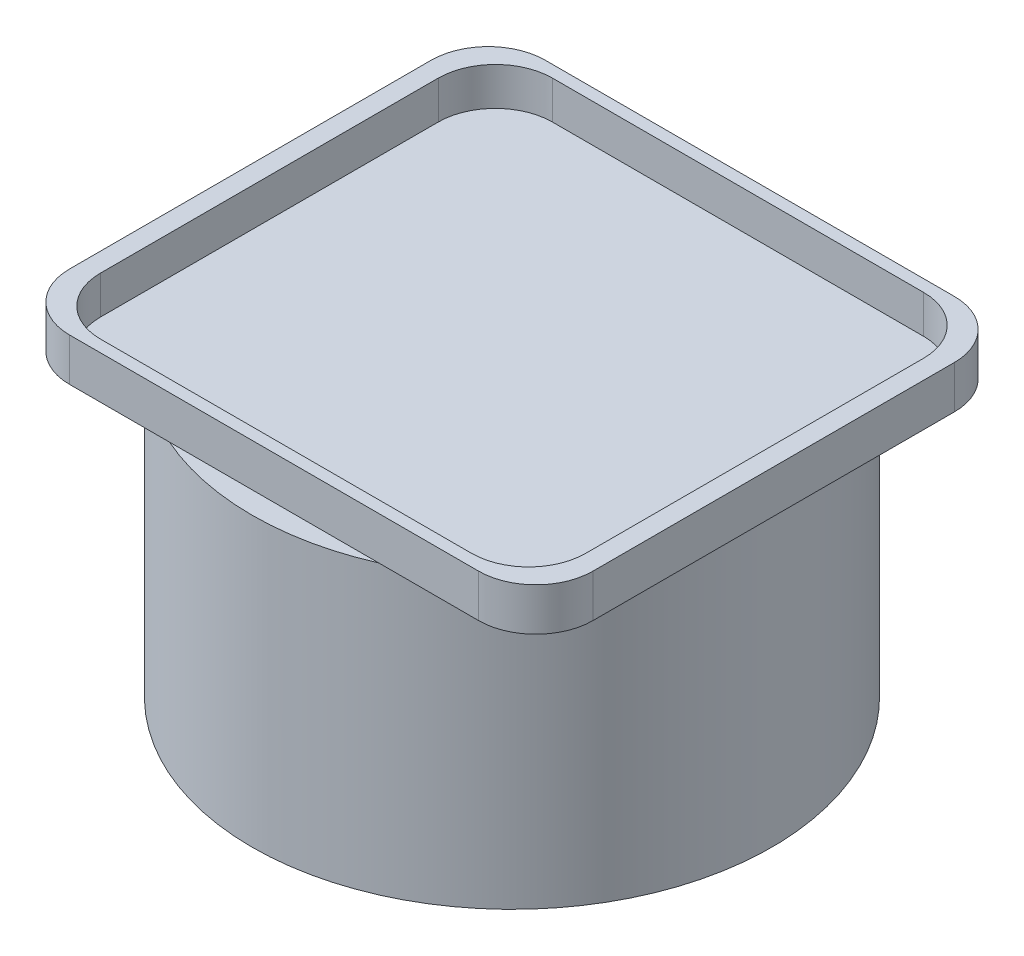
ISO-10303-21;
HEADER;
FILE_DESCRIPTION(('STEP AP214'),'2;1');
FILE_NAME('part.step','',(''),(''),'','','');
FILE_SCHEMA(('AUTOMOTIVE_DESIGN { 1 0 10303 214 1 1 1 1 }'));
ENDSEC;
DATA;
#1=APPLICATION_CONTEXT('core data for automotive mechanical design processes');
#2=APPLICATION_PROTOCOL_DEFINITION('international standard','automotive_design',2000,#1);
#3=PRODUCT_CONTEXT('',#1,'mechanical');
#4=PRODUCT('Part','Part','',(#3));
#5=PRODUCT_RELATED_PRODUCT_CATEGORY('part','',(#4));
#6=PRODUCT_DEFINITION_FORMATION('','',#4);
#7=PRODUCT_DEFINITION_CONTEXT('part definition',#1,'design');
#8=PRODUCT_DEFINITION('design','',#6,#7);
#9=PRODUCT_DEFINITION_SHAPE('','',#8);
#10=(LENGTH_UNIT() NAMED_UNIT(*) SI_UNIT(.MILLI.,.METRE.));
#11=(NAMED_UNIT(*) PLANE_ANGLE_UNIT() SI_UNIT($,.RADIAN.));
#12=(NAMED_UNIT(*) SI_UNIT($,.STERADIAN.) SOLID_ANGLE_UNIT());
#13=UNCERTAINTY_MEASURE_WITH_UNIT(LENGTH_MEASURE(1.E-05),#10,'distance_accuracy_value','');
#14=(GEOMETRIC_REPRESENTATION_CONTEXT(3) GLOBAL_UNCERTAINTY_ASSIGNED_CONTEXT((#13)) GLOBAL_UNIT_ASSIGNED_CONTEXT((#10,
#11,#12)) REPRESENTATION_CONTEXT('',''));
#15=CARTESIAN_POINT('',(0.,0.,0.));
#16=DIRECTION('',(0.,0.,1.));
#17=DIRECTION('',(1.,0.,0.));
#18=AXIS2_PLACEMENT_3D('',#15,#16,#17);
#19=CARTESIAN_POINT('',(-10.922,-0.254,-9.652));
#20=DIRECTION('',(0.,-1.,0.));
#21=DIRECTION('',(0.,0.,-1.));
#22=AXIS2_PLACEMENT_3D('',#19,#20,#21);
#23=PLANE('',#22);
#24=CARTESIAN_POINT('',(0.,-0.254,0.));
#25=DIRECTION('',(0.,-1.,0.));
#26=DIRECTION('',(0.,0.,-1.));
#27=AXIS2_PLACEMENT_3D('',#24,#25,#26);
#28=CIRCLE('',#27,13.87475);
#29=CARTESIAN_POINT('',(5.58736857227979,-0.254,-12.7));
#30=VERTEX_POINT('',#29);
#31=CARTESIAN_POINT('',(5.5873685722798,-0.254,12.7));
#32=VERTEX_POINT('',#31);
#33=EDGE_CURVE('E44',#30,#32,#28,.T.);
#34=ORIENTED_EDGE('',*,*,#33,.F.);
#35=DIRECTION('',(1.,0.,0.));
#36=VECTOR('',#35,1.);
#37=CARTESIAN_POINT('',(-10.922,-0.254,-12.7));
#38=LINE('',#37,#36);
#39=CARTESIAN_POINT('',(10.922,-0.254,-12.7));
#40=VERTEX_POINT('',#39);
#41=EDGE_CURVE('E171',#30,#40,#38,.T.);
#42=ORIENTED_EDGE('',*,*,#41,.T.);
#43=CARTESIAN_POINT('',(10.922,-0.254,-9.652));
#44=DIRECTION('',(0.,-1.,0.));
#45=DIRECTION('',(0.,0.,-1.));
#46=AXIS2_PLACEMENT_3D('',#43,#44,#45);
#47=CIRCLE('',#46,3.048);
#48=CARTESIAN_POINT('',(13.97,-0.254,-9.652));
#49=VERTEX_POINT('',#48);
#50=EDGE_CURVE('E168',#40,#49,#47,.T.);
#51=ORIENTED_EDGE('',*,*,#50,.T.);
#52=DIRECTION('',(0.,0.,1.));
#53=VECTOR('',#52,1.);
#54=CARTESIAN_POINT('',(13.97,-0.254,-9.652));
#55=LINE('',#54,#53);
#56=CARTESIAN_POINT('',(13.97,-0.254,9.65199999999998));
#57=VERTEX_POINT('',#56);
#58=EDGE_CURVE('E193',#49,#57,#55,.T.);
#59=ORIENTED_EDGE('',*,*,#58,.T.);
#60=CARTESIAN_POINT('',(10.922,-0.254,9.652));
#61=DIRECTION('',(0.,-1.,0.));
#62=DIRECTION('',(0.,0.,-1.));
#63=AXIS2_PLACEMENT_3D('',#60,#61,#62);
#64=CIRCLE('',#63,3.048);
#65=CARTESIAN_POINT('',(10.922,-0.254,12.7));
#66=VERTEX_POINT('',#65);
#67=EDGE_CURVE('E196',#57,#66,#64,.T.);
#68=ORIENTED_EDGE('',*,*,#67,.T.);
#69=DIRECTION('',(-1.,0.,0.));
#70=VECTOR('',#69,1.);
#71=CARTESIAN_POINT('',(10.922,-0.254,12.7));
#72=LINE('',#71,#70);
#73=EDGE_CURVE('E200',#66,#32,#72,.T.);
#74=ORIENTED_EDGE('',*,*,#73,.T.);
#75=EDGE_LOOP('',(#34,#42,#51,#59,#68,#74));
#76=FACE_BOUND('',#75,.T.);
#77=ADVANCED_FACE('F34',(#76),#23,.T.);
#78=CARTESIAN_POINT('',(-10.922,2.032,-9.652));
#79=DIRECTION('',(0.,-1.,0.));
#80=DIRECTION('',(0.,0.,-1.));
#81=AXIS2_PLACEMENT_3D('',#78,#79,#80);
#82=PLANE('',#81);
#83=CARTESIAN_POINT('',(-10.922,2.032,-9.652));
#84=DIRECTION('',(0.,1.,0.));
#85=DIRECTION('',(0.,0.,-1.));
#86=AXIS2_PLACEMENT_3D('',#83,#84,#85);
#87=CIRCLE('',#86,3.048);
#88=CARTESIAN_POINT('',(-10.922,2.032,-12.7));
#89=VERTEX_POINT('',#88);
#90=CARTESIAN_POINT('',(-13.97,2.032,-9.65199999999998));
#91=VERTEX_POINT('',#90);
#92=EDGE_CURVE('E267',#89,#91,#87,.T.);
#93=ORIENTED_EDGE('',*,*,#92,.T.);
#94=DIRECTION('',(0.,0.,1.));
#95=VECTOR('',#94,1.);
#96=CARTESIAN_POINT('',(-13.97,2.032,9.65199999999998));
#97=LINE('',#96,#95);
#98=CARTESIAN_POINT('',(-13.97,2.032,9.65199999999998));
#99=VERTEX_POINT('',#98);
#100=EDGE_CURVE('E270',#91,#99,#97,.T.);
#101=ORIENTED_EDGE('',*,*,#100,.T.);
#102=CARTESIAN_POINT('',(-10.922,2.032,9.652));
#103=DIRECTION('',(0.,1.,0.));
#104=DIRECTION('',(0.,0.,-1.));
#105=AXIS2_PLACEMENT_3D('',#102,#103,#104);
#106=CIRCLE('',#105,3.048);
#107=CARTESIAN_POINT('',(-10.922,2.032,12.7));
#108=VERTEX_POINT('',#107);
#109=EDGE_CURVE('E272',#99,#108,#106,.T.);
#110=ORIENTED_EDGE('',*,*,#109,.T.);
#111=DIRECTION('',(1.,0.,0.));
#112=VECTOR('',#111,1.);
#113=CARTESIAN_POINT('',(-10.922,2.032,12.7));
#114=LINE('',#113,#112);
#115=CARTESIAN_POINT('',(10.922,2.032,12.7));
#116=VERTEX_POINT('',#115);
#117=EDGE_CURVE('E274',#108,#116,#114,.T.);
#118=ORIENTED_EDGE('',*,*,#117,.T.);
#119=CARTESIAN_POINT('',(10.922,2.032,9.652));
#120=DIRECTION('',(0.,1.,0.));
#121=DIRECTION('',(0.,0.,-1.));
#122=AXIS2_PLACEMENT_3D('',#119,#120,#121);
#123=CIRCLE('',#122,3.048);
#124=CARTESIAN_POINT('',(13.97,2.032,9.65199999999998));
#125=VERTEX_POINT('',#124);
#126=EDGE_CURVE('E276',#116,#125,#123,.T.);
#127=ORIENTED_EDGE('',*,*,#126,.T.);
#128=DIRECTION('',(0.,0.,-1.));
#129=VECTOR('',#128,1.);
#130=CARTESIAN_POINT('',(13.97,2.032,9.65199999999998));
#131=LINE('',#130,#129);
#132=CARTESIAN_POINT('',(13.97,2.032,-9.65199999999998));
#133=VERTEX_POINT('',#132);
#134=EDGE_CURVE('E278',#125,#133,#131,.T.);
#135=ORIENTED_EDGE('',*,*,#134,.T.);
#136=CARTESIAN_POINT('',(10.922,2.032,-9.652));
#137=DIRECTION('',(0.,1.,0.));
#138=DIRECTION('',(0.,0.,-1.));
#139=AXIS2_PLACEMENT_3D('',#136,#137,#138);
#140=CIRCLE('',#139,3.048);
#141=CARTESIAN_POINT('',(10.922,2.032,-12.7));
#142=VERTEX_POINT('',#141);
#143=EDGE_CURVE('E280',#133,#142,#140,.T.);
#144=ORIENTED_EDGE('',*,*,#143,.T.);
#145=DIRECTION('',(-1.,0.,0.));
#146=VECTOR('',#145,1.);
#147=CARTESIAN_POINT('',(-10.922,2.032,-12.7));
#148=LINE('',#147,#146);
#149=EDGE_CURVE('E282',#142,#89,#148,.T.);
#150=ORIENTED_EDGE('',*,*,#149,.T.);
#151=EDGE_LOOP('',(#93,#101,#110,#118,#127,#135,#144,#150));
#152=FACE_BOUND('',#151,.T.);
#153=CARTESIAN_POINT('',(-9.906,2.032,9.017));
#154=DIRECTION('',(0.,1.,0.));
#155=DIRECTION('',(0.,0.,1.));
#156=AXIS2_PLACEMENT_3D('',#153,#154,#155);
#157=CIRCLE('',#156,3.048);
#158=CARTESIAN_POINT('',(-12.954,2.032,9.01699999999998));
#159=VERTEX_POINT('',#158);
#160=CARTESIAN_POINT('',(-9.90599999999998,2.032,12.065));
#161=VERTEX_POINT('',#160);
#162=EDGE_CURVE('E208',#159,#161,#157,.T.);
#163=ORIENTED_EDGE('',*,*,#162,.F.);
#164=DIRECTION('',(0.,0.,1.));
#165=VECTOR('',#164,1.);
#166=CARTESIAN_POINT('',(-12.954,2.032,9.01699999999998));
#167=LINE('',#166,#165);
#168=CARTESIAN_POINT('',(-12.954,2.032,-9.01699999999998));
#169=VERTEX_POINT('',#168);
#170=EDGE_CURVE('E224',#169,#159,#167,.T.);
#171=ORIENTED_EDGE('',*,*,#170,.F.);
#172=CARTESIAN_POINT('',(-9.906,2.032,-9.017));
#173=DIRECTION('',(0.,1.,0.));
#174=DIRECTION('',(0.,0.,1.));
#175=AXIS2_PLACEMENT_3D('',#172,#173,#174);
#176=CIRCLE('',#175,3.048);
#177=CARTESIAN_POINT('',(-9.90599999999998,2.032,-12.065));
#178=VERTEX_POINT('',#177);
#179=EDGE_CURVE('E221',#178,#169,#176,.T.);
#180=ORIENTED_EDGE('',*,*,#179,.F.);
#181=DIRECTION('',(-1.,0.,0.));
#182=VECTOR('',#181,1.);
#183=CARTESIAN_POINT('',(-9.90599999999998,2.032,-12.065));
#184=LINE('',#183,#182);
#185=CARTESIAN_POINT('',(9.90599999999998,2.032,-12.065));
#186=VERTEX_POINT('',#185);
#187=EDGE_CURVE('E219',#186,#178,#184,.T.);
#188=ORIENTED_EDGE('',*,*,#187,.F.);
#189=CARTESIAN_POINT('',(9.906,2.032,-9.017));
#190=DIRECTION('',(0.,1.,0.));
#191=DIRECTION('',(0.,0.,1.));
#192=AXIS2_PLACEMENT_3D('',#189,#190,#191);
#193=CIRCLE('',#192,3.048);
#194=CARTESIAN_POINT('',(12.954,2.032,-9.01699999999998));
#195=VERTEX_POINT('',#194);
#196=EDGE_CURVE('E217',#195,#186,#193,.T.);
#197=ORIENTED_EDGE('',*,*,#196,.F.);
#198=DIRECTION('',(0.,0.,-1.));
#199=VECTOR('',#198,1.);
#200=CARTESIAN_POINT('',(12.954,2.032,9.01699999999998));
#201=LINE('',#200,#199);
#202=CARTESIAN_POINT('',(12.954,2.032,9.01699999999998));
#203=VERTEX_POINT('',#202);
#204=EDGE_CURVE('E215',#203,#195,#201,.T.);
#205=ORIENTED_EDGE('',*,*,#204,.F.);
#206=CARTESIAN_POINT('',(9.906,2.032,9.017));
#207=DIRECTION('',(0.,1.,0.));
#208=DIRECTION('',(0.,0.,1.));
#209=AXIS2_PLACEMENT_3D('',#206,#207,#208);
#210=CIRCLE('',#209,3.048);
#211=CARTESIAN_POINT('',(9.90599999999998,2.032,12.065));
#212=VERTEX_POINT('',#211);
#213=EDGE_CURVE('E213',#212,#203,#210,.T.);
#214=ORIENTED_EDGE('',*,*,#213,.F.);
#215=DIRECTION('',(1.,0.,0.));
#216=VECTOR('',#215,1.);
#217=CARTESIAN_POINT('',(-9.90599999999998,2.032,12.065));
#218=LINE('',#217,#216);
#219=EDGE_CURVE('E210',#161,#212,#218,.T.);
#220=ORIENTED_EDGE('',*,*,#219,.F.);
#221=EDGE_LOOP('',(#163,#171,#180,#188,#197,#205,#214,#220));
#222=FACE_BOUND('',#221,.T.);
#223=ADVANCED_FACE('F311',(#152,#222),#82,.F.);
#224=CARTESIAN_POINT('',(-10.922,2.032,-9.652));
#225=DIRECTION('',(0.,-1.,0.));
#226=DIRECTION('',(0.,0.,-1.));
#227=AXIS2_PLACEMENT_3D('',#224,#225,#226);
#228=CYLINDRICAL_SURFACE('',#227,3.048);
#229=DIRECTION('',(0.,-1.,0.));
#230=VECTOR('',#229,1.);
#231=CARTESIAN_POINT('',(-10.922,2.032,-12.7));
#232=LINE('',#231,#230);
#233=CARTESIAN_POINT('',(-10.922,-0.254,-12.7));
#234=VERTEX_POINT('',#233);
#235=EDGE_CURVE('E284',#89,#234,#232,.T.);
#236=ORIENTED_EDGE('',*,*,#235,.T.);
#237=CARTESIAN_POINT('',(-10.922,-0.254,-9.652));
#238=DIRECTION('',(0.,-1.,0.));
#239=DIRECTION('',(0.,0.,-1.));
#240=AXIS2_PLACEMENT_3D('',#237,#238,#239);
#241=CIRCLE('',#240,3.048);
#242=CARTESIAN_POINT('',(-13.97,-0.254,-9.65199999999998));
#243=VERTEX_POINT('',#242);
#244=EDGE_CURVE('E165',#243,#234,#241,.T.);
#245=ORIENTED_EDGE('',*,*,#244,.F.);
#246=DIRECTION('',(0.,-1.,0.));
#247=VECTOR('',#246,1.);
#248=CARTESIAN_POINT('',(-13.97,2.032,-9.65199999999998));
#249=LINE('',#248,#247);
#250=EDGE_CURVE('E38',#91,#243,#249,.T.);
#251=ORIENTED_EDGE('',*,*,#250,.F.);
#252=ORIENTED_EDGE('',*,*,#92,.F.);
#253=EDGE_LOOP('',(#236,#245,#251,#252));
#254=FACE_BOUND('',#253,.T.);
#255=ADVANCED_FACE('F36',(#254),#228,.T.);
#256=CARTESIAN_POINT('',(-13.97,2.032,9.65199999999998));
#257=DIRECTION('',(1.,0.,0.));
#258=DIRECTION('',(0.,0.,-1.));
#259=AXIS2_PLACEMENT_3D('',#256,#257,#258);
#260=PLANE('',#259);
#261=ORIENTED_EDGE('',*,*,#250,.T.);
#262=DIRECTION('',(0.,0.,-1.));
#263=VECTOR('',#262,1.);
#264=CARTESIAN_POINT('',(-13.97,-0.254,9.65199999999998));
#265=LINE('',#264,#263);
#266=CARTESIAN_POINT('',(-13.97,-0.254,9.65199999999998));
#267=VERTEX_POINT('',#266);
#268=EDGE_CURVE('E205',#267,#243,#265,.T.);
#269=ORIENTED_EDGE('',*,*,#268,.F.);
#270=DIRECTION('',(0.,-1.,0.));
#271=VECTOR('',#270,1.);
#272=CARTESIAN_POINT('',(-13.97,2.032,9.65199999999998));
#273=LINE('',#272,#271);
#274=EDGE_CURVE('E296',#99,#267,#273,.T.);
#275=ORIENTED_EDGE('',*,*,#274,.F.);
#276=ORIENTED_EDGE('',*,*,#100,.F.);
#277=EDGE_LOOP('',(#261,#269,#275,#276));
#278=FACE_BOUND('',#277,.T.);
#279=ADVANCED_FACE('F304',(#278),#260,.F.);
#280=CARTESIAN_POINT('',(-10.922,2.032,9.652));
#281=DIRECTION('',(0.,-1.,0.));
#282=DIRECTION('',(0.,0.,-1.));
#283=AXIS2_PLACEMENT_3D('',#280,#281,#282);
#284=CYLINDRICAL_SURFACE('',#283,3.048);
#285=ORIENTED_EDGE('',*,*,#274,.T.);
#286=CARTESIAN_POINT('',(-10.922,-0.254,9.652));
#287=DIRECTION('',(0.,-1.,0.));
#288=DIRECTION('',(0.,0.,-1.));
#289=AXIS2_PLACEMENT_3D('',#286,#287,#288);
#290=CIRCLE('',#289,3.048);
#291=CARTESIAN_POINT('',(-10.922,-0.254,12.7));
#292=VERTEX_POINT('',#291);
#293=EDGE_CURVE('E202',#292,#267,#290,.T.);
#294=ORIENTED_EDGE('',*,*,#293,.F.);
#295=DIRECTION('',(0.,-1.,0.));
#296=VECTOR('',#295,1.);
#297=CARTESIAN_POINT('',(-10.922,2.032,12.7));
#298=LINE('',#297,#296);
#299=EDGE_CURVE('E294',#108,#292,#298,.T.);
#300=ORIENTED_EDGE('',*,*,#299,.F.);
#301=ORIENTED_EDGE('',*,*,#109,.F.);
#302=EDGE_LOOP('',(#285,#294,#300,#301));
#303=FACE_BOUND('',#302,.T.);
#304=ADVANCED_FACE('F331',(#303),#284,.T.);
#305=CARTESIAN_POINT('',(-10.922,2.032,12.7));
#306=DIRECTION('',(0.,0.,-1.));
#307=DIRECTION('',(-1.,0.,0.));
#308=AXIS2_PLACEMENT_3D('',#305,#306,#307);
#309=PLANE('',#308);
#310=ORIENTED_EDGE('',*,*,#299,.T.);
#311=CARTESIAN_POINT('',(-5.5873685722798,-0.254,12.7));
#312=VERTEX_POINT('',#311);
#313=EDGE_CURVE('E199',#312,#292,#72,.T.);
#314=ORIENTED_EDGE('',*,*,#313,.F.);
#315=EDGE_CURVE('E57',#32,#312,#72,.T.);
#316=ORIENTED_EDGE('',*,*,#315,.F.);
#317=ORIENTED_EDGE('',*,*,#73,.F.);
#318=DIRECTION('',(0.,-1.,0.));
#319=VECTOR('',#318,1.);
#320=CARTESIAN_POINT('',(10.922,2.032,12.7));
#321=LINE('',#320,#319);
#322=EDGE_CURVE('E292',#116,#66,#321,.T.);
#323=ORIENTED_EDGE('',*,*,#322,.F.);
#324=ORIENTED_EDGE('',*,*,#117,.F.);
#325=EDGE_LOOP('',(#310,#314,#316,#317,#323,#324));
#326=FACE_BOUND('',#325,.T.);
#327=ADVANCED_FACE('F328',(#326),#309,.F.);
#328=CARTESIAN_POINT('',(10.922,2.032,9.652));
#329=DIRECTION('',(0.,-1.,0.));
#330=DIRECTION('',(0.,0.,-1.));
#331=AXIS2_PLACEMENT_3D('',#328,#329,#330);
#332=CYLINDRICAL_SURFACE('',#331,3.048);
#333=ORIENTED_EDGE('',*,*,#322,.T.);
#334=ORIENTED_EDGE('',*,*,#67,.F.);
#335=DIRECTION('',(0.,-1.,0.));
#336=VECTOR('',#335,1.);
#337=CARTESIAN_POINT('',(13.97,2.032,9.65199999999998));
#338=LINE('',#337,#336);
#339=EDGE_CURVE('E290',#125,#57,#338,.T.);
#340=ORIENTED_EDGE('',*,*,#339,.F.);
#341=ORIENTED_EDGE('',*,*,#126,.F.);
#342=EDGE_LOOP('',(#333,#334,#340,#341));
#343=FACE_BOUND('',#342,.T.);
#344=ADVANCED_FACE('F326',(#343),#332,.T.);
#345=CARTESIAN_POINT('',(13.97,2.032,9.65199999999998));
#346=DIRECTION('',(-1.,0.,0.));
#347=DIRECTION('',(0.,0.,1.));
#348=AXIS2_PLACEMENT_3D('',#345,#346,#347);
#349=PLANE('',#348);
#350=ORIENTED_EDGE('',*,*,#339,.T.);
#351=ORIENTED_EDGE('',*,*,#58,.F.);
#352=DIRECTION('',(0.,-1.,0.));
#353=VECTOR('',#352,1.);
#354=CARTESIAN_POINT('',(13.97,2.032,-9.65199999999998));
#355=LINE('',#354,#353);
#356=EDGE_CURVE('E288',#133,#49,#355,.T.);
#357=ORIENTED_EDGE('',*,*,#356,.F.);
#358=ORIENTED_EDGE('',*,*,#134,.F.);
#359=EDGE_LOOP('',(#350,#351,#357,#358));
#360=FACE_BOUND('',#359,.T.);
#361=ADVANCED_FACE('F322',(#360),#349,.F.);
#362=CARTESIAN_POINT('',(10.922,2.032,-9.652));
#363=DIRECTION('',(0.,-1.,0.));
#364=DIRECTION('',(0.,0.,-1.));
#365=AXIS2_PLACEMENT_3D('',#362,#363,#364);
#366=CYLINDRICAL_SURFACE('',#365,3.048);
#367=ORIENTED_EDGE('',*,*,#356,.T.);
#368=ORIENTED_EDGE('',*,*,#50,.F.);
#369=DIRECTION('',(0.,-1.,0.));
#370=VECTOR('',#369,1.);
#371=CARTESIAN_POINT('',(10.922,2.032,-12.7));
#372=LINE('',#371,#370);
#373=EDGE_CURVE('E286',#142,#40,#372,.T.);
#374=ORIENTED_EDGE('',*,*,#373,.F.);
#375=ORIENTED_EDGE('',*,*,#143,.F.);
#376=EDGE_LOOP('',(#367,#368,#374,#375));
#377=FACE_BOUND('',#376,.T.);
#378=ADVANCED_FACE('F317',(#377),#366,.T.);
#379=CARTESIAN_POINT('',(-10.922,2.032,-12.7));
#380=DIRECTION('',(0.,0.,1.));
#381=DIRECTION('',(1.,0.,0.));
#382=AXIS2_PLACEMENT_3D('',#379,#380,#381);
#383=PLANE('',#382);
#384=ORIENTED_EDGE('',*,*,#373,.T.);
#385=ORIENTED_EDGE('',*,*,#41,.F.);
#386=CARTESIAN_POINT('',(-5.58736857227979,-0.254,-12.7));
#387=VERTEX_POINT('',#386);
#388=EDGE_CURVE('E169',#387,#30,#38,.T.);
#389=ORIENTED_EDGE('',*,*,#388,.F.);
#390=EDGE_CURVE('E160',#234,#387,#38,.T.);
#391=ORIENTED_EDGE('',*,*,#390,.F.);
#392=ORIENTED_EDGE('',*,*,#235,.F.);
#393=ORIENTED_EDGE('',*,*,#149,.F.);
#394=EDGE_LOOP('',(#384,#385,#389,#391,#392,#393));
#395=FACE_BOUND('',#394,.T.);
#396=ADVANCED_FACE('F176',(#395),#383,.F.);
#397=CARTESIAN_POINT('',(-9.906,2.032,9.017));
#398=DIRECTION('',(0.,-1.,0.));
#399=DIRECTION('',(0.,0.,-1.));
#400=AXIS2_PLACEMENT_3D('',#397,#398,#399);
#401=CYLINDRICAL_SURFACE('',#400,3.048);
#402=CARTESIAN_POINT('',(-9.906,0.,9.017));
#403=DIRECTION('',(0.,1.,0.));
#404=DIRECTION('',(0.,0.,1.));
#405=AXIS2_PLACEMENT_3D('',#402,#403,#404);
#406=CIRCLE('',#405,3.048);
#407=CARTESIAN_POINT('',(-12.954,0.,9.01699999999998));
#408=VERTEX_POINT('',#407);
#409=CARTESIAN_POINT('',(-9.90599999999998,0.,12.065));
#410=VERTEX_POINT('',#409);
#411=EDGE_CURVE('E207',#408,#410,#406,.T.);
#412=ORIENTED_EDGE('',*,*,#411,.F.);
#413=DIRECTION('',(0.,-1.,0.));
#414=VECTOR('',#413,1.);
#415=CARTESIAN_POINT('',(-12.954,2.032,9.01699999999998));
#416=LINE('',#415,#414);
#417=EDGE_CURVE('E226',#159,#408,#416,.T.);
#418=ORIENTED_EDGE('',*,*,#417,.F.);
#419=ORIENTED_EDGE('',*,*,#162,.T.);
#420=DIRECTION('',(0.,-1.,0.));
#421=VECTOR('',#420,1.);
#422=CARTESIAN_POINT('',(-9.90599999999998,2.032,12.065));
#423=LINE('',#422,#421);
#424=EDGE_CURVE('E264',#161,#410,#423,.T.);
#425=ORIENTED_EDGE('',*,*,#424,.T.);
#426=EDGE_LOOP('',(#412,#418,#419,#425));
#427=FACE_BOUND('',#426,.T.);
#428=ADVANCED_FACE('F386',(#427),#401,.F.);
#429=CARTESIAN_POINT('',(-9.90599999999998,2.032,12.065));
#430=DIRECTION('',(0.,0.,-1.));
#431=DIRECTION('',(-1.,0.,0.));
#432=AXIS2_PLACEMENT_3D('',#429,#430,#431);
#433=PLANE('',#432);
#434=DIRECTION('',(1.,0.,0.));
#435=VECTOR('',#434,1.);
#436=CARTESIAN_POINT('',(-9.90599999999998,0.,12.065));
#437=LINE('',#436,#435);
#438=CARTESIAN_POINT('',(9.90599999999998,0.,12.065));
#439=VERTEX_POINT('',#438);
#440=EDGE_CURVE('E229',#410,#439,#437,.T.);
#441=ORIENTED_EDGE('',*,*,#440,.F.);
#442=ORIENTED_EDGE('',*,*,#424,.F.);
#443=ORIENTED_EDGE('',*,*,#219,.T.);
#444=DIRECTION('',(0.,-1.,0.));
#445=VECTOR('',#444,1.);
#446=CARTESIAN_POINT('',(9.90599999999998,2.032,12.065));
#447=LINE('',#446,#445);
#448=EDGE_CURVE('E262',#212,#439,#447,.T.);
#449=ORIENTED_EDGE('',*,*,#448,.T.);
#450=EDGE_LOOP('',(#441,#442,#443,#449));
#451=FACE_BOUND('',#450,.T.);
#452=ADVANCED_FACE('F382',(#451),#433,.T.);
#453=CARTESIAN_POINT('',(9.906,2.032,9.017));
#454=DIRECTION('',(0.,-1.,0.));
#455=DIRECTION('',(0.,0.,-1.));
#456=AXIS2_PLACEMENT_3D('',#453,#454,#455);
#457=CYLINDRICAL_SURFACE('',#456,3.048);
#458=CARTESIAN_POINT('',(9.906,0.,9.017));
#459=DIRECTION('',(0.,1.,0.));
#460=DIRECTION('',(0.,0.,1.));
#461=AXIS2_PLACEMENT_3D('',#458,#459,#460);
#462=CIRCLE('',#461,3.048);
#463=CARTESIAN_POINT('',(12.954,0.,9.01699999999998));
#464=VERTEX_POINT('',#463);
#465=EDGE_CURVE('E232',#439,#464,#462,.T.);
#466=ORIENTED_EDGE('',*,*,#465,.F.);
#467=ORIENTED_EDGE('',*,*,#448,.F.);
#468=ORIENTED_EDGE('',*,*,#213,.T.);
#469=DIRECTION('',(0.,-1.,0.));
#470=VECTOR('',#469,1.);
#471=CARTESIAN_POINT('',(12.954,2.032,9.01699999999998));
#472=LINE('',#471,#470);
#473=EDGE_CURVE('E260',#203,#464,#472,.T.);
#474=ORIENTED_EDGE('',*,*,#473,.T.);
#475=EDGE_LOOP('',(#466,#467,#468,#474));
#476=FACE_BOUND('',#475,.T.);
#477=ADVANCED_FACE('F378',(#476),#457,.F.);
#478=CARTESIAN_POINT('',(12.954,2.032,9.01699999999998));
#479=DIRECTION('',(-1.,0.,0.));
#480=DIRECTION('',(0.,0.,1.));
#481=AXIS2_PLACEMENT_3D('',#478,#479,#480);
#482=PLANE('',#481);
#483=DIRECTION('',(0.,0.,-1.));
#484=VECTOR('',#483,1.);
#485=CARTESIAN_POINT('',(12.954,0.,9.01699999999998));
#486=LINE('',#485,#484);
#487=CARTESIAN_POINT('',(12.954,0.,-9.01699999999998));
#488=VERTEX_POINT('',#487);
#489=EDGE_CURVE('E235',#464,#488,#486,.T.);
#490=ORIENTED_EDGE('',*,*,#489,.F.);
#491=ORIENTED_EDGE('',*,*,#473,.F.);
#492=ORIENTED_EDGE('',*,*,#204,.T.);
#493=DIRECTION('',(0.,-1.,0.));
#494=VECTOR('',#493,1.);
#495=CARTESIAN_POINT('',(12.954,2.032,-9.01699999999998));
#496=LINE('',#495,#494);
#497=EDGE_CURVE('E258',#195,#488,#496,.T.);
#498=ORIENTED_EDGE('',*,*,#497,.T.);
#499=EDGE_LOOP('',(#490,#491,#492,#498));
#500=FACE_BOUND('',#499,.T.);
#501=ADVANCED_FACE('F374',(#500),#482,.T.);
#502=CARTESIAN_POINT('',(9.906,2.032,-9.017));
#503=DIRECTION('',(0.,-1.,0.));
#504=DIRECTION('',(0.,0.,-1.));
#505=AXIS2_PLACEMENT_3D('',#502,#503,#504);
#506=CYLINDRICAL_SURFACE('',#505,3.048);
#507=CARTESIAN_POINT('',(9.906,0.,-9.017));
#508=DIRECTION('',(0.,1.,0.));
#509=DIRECTION('',(0.,0.,1.));
#510=AXIS2_PLACEMENT_3D('',#507,#508,#509);
#511=CIRCLE('',#510,3.048);
#512=CARTESIAN_POINT('',(9.90599999999998,0.,-12.065));
#513=VERTEX_POINT('',#512);
#514=EDGE_CURVE('E238',#488,#513,#511,.T.);
#515=ORIENTED_EDGE('',*,*,#514,.F.);
#516=ORIENTED_EDGE('',*,*,#497,.F.);
#517=ORIENTED_EDGE('',*,*,#196,.T.);
#518=DIRECTION('',(0.,-1.,0.));
#519=VECTOR('',#518,1.);
#520=CARTESIAN_POINT('',(9.90599999999998,2.032,-12.065));
#521=LINE('',#520,#519);
#522=EDGE_CURVE('E256',#186,#513,#521,.T.);
#523=ORIENTED_EDGE('',*,*,#522,.T.);
#524=EDGE_LOOP('',(#515,#516,#517,#523));
#525=FACE_BOUND('',#524,.T.);
#526=ADVANCED_FACE('F370',(#525),#506,.F.);
#527=CARTESIAN_POINT('',(-9.90599999999998,2.032,-12.065));
#528=DIRECTION('',(0.,0.,1.));
#529=DIRECTION('',(1.,0.,0.));
#530=AXIS2_PLACEMENT_3D('',#527,#528,#529);
#531=PLANE('',#530);
#532=DIRECTION('',(-1.,0.,0.));
#533=VECTOR('',#532,1.);
#534=CARTESIAN_POINT('',(-9.90599999999998,0.,-12.065));
#535=LINE('',#534,#533);
#536=CARTESIAN_POINT('',(-9.90599999999998,0.,-12.065));
#537=VERTEX_POINT('',#536);
#538=EDGE_CURVE('E241',#513,#537,#535,.T.);
#539=ORIENTED_EDGE('',*,*,#538,.F.);
#540=ORIENTED_EDGE('',*,*,#522,.F.);
#541=ORIENTED_EDGE('',*,*,#187,.T.);
#542=DIRECTION('',(0.,-1.,0.));
#543=VECTOR('',#542,1.);
#544=CARTESIAN_POINT('',(-9.90599999999998,2.032,-12.065));
#545=LINE('',#544,#543);
#546=EDGE_CURVE('E254',#178,#537,#545,.T.);
#547=ORIENTED_EDGE('',*,*,#546,.T.);
#548=EDGE_LOOP('',(#539,#540,#541,#547));
#549=FACE_BOUND('',#548,.T.);
#550=ADVANCED_FACE('F366',(#549),#531,.T.);
#551=CARTESIAN_POINT('',(-9.906,2.032,-9.017));
#552=DIRECTION('',(0.,-1.,0.));
#553=DIRECTION('',(0.,0.,-1.));
#554=AXIS2_PLACEMENT_3D('',#551,#552,#553);
#555=CYLINDRICAL_SURFACE('',#554,3.048);
#556=CARTESIAN_POINT('',(-9.906,0.,-9.017));
#557=DIRECTION('',(0.,1.,0.));
#558=DIRECTION('',(0.,0.,1.));
#559=AXIS2_PLACEMENT_3D('',#556,#557,#558);
#560=CIRCLE('',#559,3.048);
#561=CARTESIAN_POINT('',(-12.954,0.,-9.01699999999998));
#562=VERTEX_POINT('',#561);
#563=EDGE_CURVE('E244',#537,#562,#560,.T.);
#564=ORIENTED_EDGE('',*,*,#563,.F.);
#565=ORIENTED_EDGE('',*,*,#546,.F.);
#566=ORIENTED_EDGE('',*,*,#179,.T.);
#567=DIRECTION('',(0.,-1.,0.));
#568=VECTOR('',#567,1.);
#569=CARTESIAN_POINT('',(-12.954,2.032,-9.01699999999998));
#570=LINE('',#569,#568);
#571=EDGE_CURVE('E251',#169,#562,#570,.T.);
#572=ORIENTED_EDGE('',*,*,#571,.T.);
#573=EDGE_LOOP('',(#564,#565,#566,#572));
#574=FACE_BOUND('',#573,.T.);
#575=ADVANCED_FACE('F360',(#574),#555,.F.);
#576=CARTESIAN_POINT('',(-12.954,2.032,9.01699999999998));
#577=DIRECTION('',(1.,0.,0.));
#578=DIRECTION('',(0.,0.,-1.));
#579=AXIS2_PLACEMENT_3D('',#576,#577,#578);
#580=PLANE('',#579);
#581=DIRECTION('',(0.,0.,1.));
#582=VECTOR('',#581,1.);
#583=CARTESIAN_POINT('',(-12.954,0.,9.01699999999998));
#584=LINE('',#583,#582);
#585=EDGE_CURVE('E211',#562,#408,#584,.T.);
#586=ORIENTED_EDGE('',*,*,#585,.F.);
#587=ORIENTED_EDGE('',*,*,#571,.F.);
#588=ORIENTED_EDGE('',*,*,#170,.T.);
#589=ORIENTED_EDGE('',*,*,#417,.T.);
#590=EDGE_LOOP('',(#586,#587,#588,#589));
#591=FACE_BOUND('',#590,.T.);
#592=ADVANCED_FACE('F355',(#591),#580,.T.);
#593=CARTESIAN_POINT('',(-10.922,0.,-9.652));
#594=DIRECTION('',(0.,-1.,0.));
#595=DIRECTION('',(0.,0.,-1.));
#596=AXIS2_PLACEMENT_3D('',#593,#594,#595);
#597=PLANE('',#596);
#598=ORIENTED_EDGE('',*,*,#563,.T.);
#599=ORIENTED_EDGE('',*,*,#585,.T.);
#600=ORIENTED_EDGE('',*,*,#411,.T.);
#601=ORIENTED_EDGE('',*,*,#440,.T.);
#602=ORIENTED_EDGE('',*,*,#465,.T.);
#603=ORIENTED_EDGE('',*,*,#489,.T.);
#604=ORIENTED_EDGE('',*,*,#514,.T.);
#605=ORIENTED_EDGE('',*,*,#538,.T.);
#606=EDGE_LOOP('',(#598,#599,#600,#601,#602,#603,#604,#605));
#607=FACE_BOUND('',#606,.T.);
#608=ADVANCED_FACE('F348',(#607),#597,.F.);
#609=EDGE_CURVE('E11',#312,#387,#28,.T.);
#610=ORIENTED_EDGE('',*,*,#609,.F.);
#611=ORIENTED_EDGE('',*,*,#313,.T.);
#612=ORIENTED_EDGE('',*,*,#293,.T.);
#613=ORIENTED_EDGE('',*,*,#268,.T.);
#614=ORIENTED_EDGE('',*,*,#244,.T.);
#615=ORIENTED_EDGE('',*,*,#390,.T.);
#616=EDGE_LOOP('',(#610,#611,#612,#613,#614,#615));
#617=FACE_BOUND('',#616,.T.);
#618=ADVANCED_FACE('F162',(#617),#23,.T.);
#619=CARTESIAN_POINT('',(0.,-0.254,0.));
#620=DIRECTION('',(0.,-1.,0.));
#621=DIRECTION('',(0.,0.,-1.));
#622=AXIS2_PLACEMENT_3D('',#619,#620,#621);
#623=PLANE('',#622);
#624=EDGE_CURVE('E179',#387,#30,#28,.T.);
#625=ORIENTED_EDGE('',*,*,#624,.F.);
#626=ORIENTED_EDGE('',*,*,#388,.T.);
#627=EDGE_LOOP('',(#625,#626));
#628=FACE_BOUND('',#627,.T.);
#629=ADVANCED_FACE('F180',(#628),#623,.F.);
#630=EDGE_CURVE('E45',#32,#312,#28,.T.);
#631=ORIENTED_EDGE('',*,*,#630,.F.);
#632=ORIENTED_EDGE('',*,*,#315,.T.);
#633=EDGE_LOOP('',(#631,#632));
#634=FACE_BOUND('',#633,.T.);
#635=ADVANCED_FACE('F353',(#634),#623,.F.);
#636=CARTESIAN_POINT('',(0.,-15.604,0.));
#637=DIRECTION('',(0.,1.,0.));
#638=DIRECTION('',(0.,0.,1.));
#639=AXIS2_PLACEMENT_3D('',#636,#637,#638);
#640=CYLINDRICAL_SURFACE('',#639,13.87475);
#641=CARTESIAN_POINT('',(0.,-15.604,0.));
#642=DIRECTION('',(0.,-1.,0.));
#643=DIRECTION('',(0.,0.,-1.));
#644=AXIS2_PLACEMENT_3D('',#641,#642,#643);
#645=CIRCLE('',#644,13.87475);
#646=CARTESIAN_POINT('',(0.,-15.604,-13.87475));
#647=VERTEX_POINT('',#646);
#648=EDGE_CURVE('E187',#647,#647,#645,.T.);
#649=ORIENTED_EDGE('',*,*,#648,.F.);
#650=EDGE_LOOP('',(#649));
#651=FACE_BOUND('',#650,.T.);
#652=ORIENTED_EDGE('',*,*,#33,.T.);
#653=ORIENTED_EDGE('',*,*,#630,.T.);
#654=ORIENTED_EDGE('',*,*,#609,.T.);
#655=ORIENTED_EDGE('',*,*,#624,.T.);
#656=EDGE_LOOP('',(#652,#653,#654,#655));
#657=FACE_BOUND('',#656,.T.);
#658=ADVANCED_FACE('F184',(#651,#657),#640,.T.);
#659=CARTESIAN_POINT('',(0.,-15.604,0.));
#660=DIRECTION('',(0.,-1.,0.));
#661=DIRECTION('',(0.,0.,-1.));
#662=AXIS2_PLACEMENT_3D('',#659,#660,#661);
#663=PLANE('',#662);
#664=ORIENTED_EDGE('',*,*,#648,.T.);
#665=EDGE_LOOP('',(#664));
#666=FACE_BOUND('',#665,.T.);
#667=ADVANCED_FACE('F551',(#666),#663,.T.);
#668=CLOSED_SHELL('',(#77,#223,#255,#279,#304,#327,#344,#361,#378,#396,#428,#452,#477,#501,#526,
#550,#575,#592,#608,#618,#629,#635,#658,#667));
#669=MANIFOLD_SOLID_BREP('B2',#668);
#670=ADVANCED_BREP_SHAPE_REPRESENTATION('',(#18,#669),#14);
#671=SHAPE_DEFINITION_REPRESENTATION(#9,#670);
ENDSEC;
END-ISO-10303-21;
